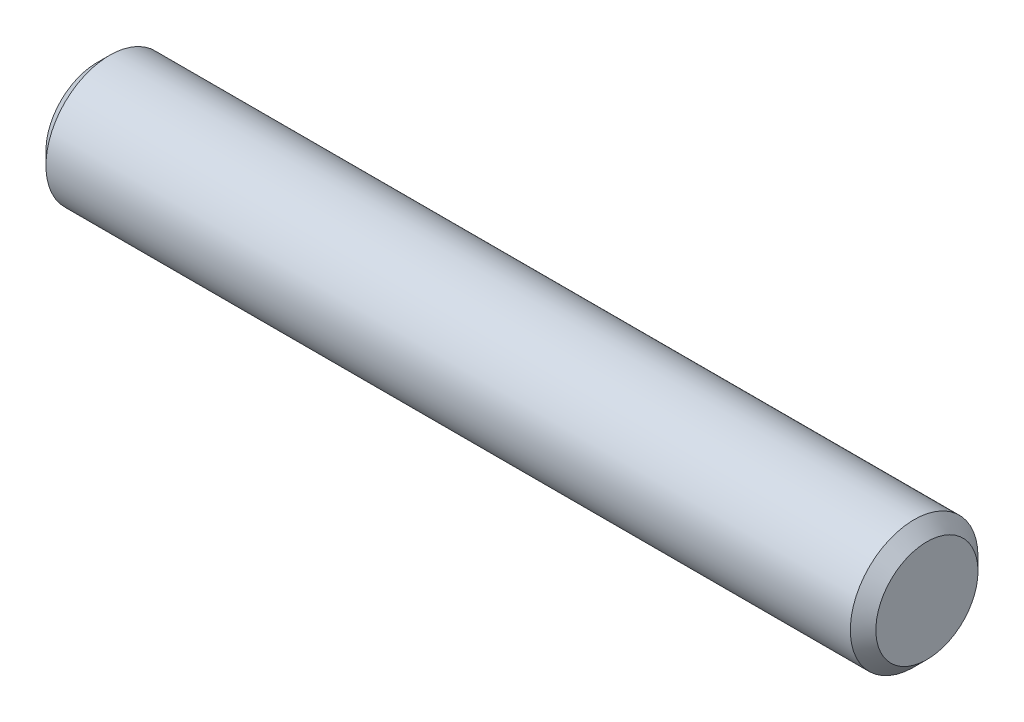
ISO-10303-21;
HEADER;
FILE_DESCRIPTION(('STEP AP214'),'2;1');
FILE_NAME('part.step','',(''),(''),'','','');
FILE_SCHEMA(('AUTOMOTIVE_DESIGN { 1 0 10303 214 1 1 1 1 }'));
ENDSEC;
DATA;
#1=APPLICATION_CONTEXT('core data for automotive mechanical design processes');
#2=APPLICATION_PROTOCOL_DEFINITION('international standard','automotive_design',2000,#1);
#3=PRODUCT_CONTEXT('',#1,'mechanical');
#4=PRODUCT('Part','Part','',(#3));
#5=PRODUCT_RELATED_PRODUCT_CATEGORY('part','',(#4));
#6=PRODUCT_DEFINITION_FORMATION('','',#4);
#7=PRODUCT_DEFINITION_CONTEXT('part definition',#1,'design');
#8=PRODUCT_DEFINITION('design','',#6,#7);
#9=PRODUCT_DEFINITION_SHAPE('','',#8);
#10=(LENGTH_UNIT() NAMED_UNIT(*) SI_UNIT(.MILLI.,.METRE.));
#11=(NAMED_UNIT(*) PLANE_ANGLE_UNIT() SI_UNIT($,.RADIAN.));
#12=(NAMED_UNIT(*) SI_UNIT($,.STERADIAN.) SOLID_ANGLE_UNIT());
#13=UNCERTAINTY_MEASURE_WITH_UNIT(LENGTH_MEASURE(1.E-05),#10,'distance_accuracy_value','');
#14=(GEOMETRIC_REPRESENTATION_CONTEXT(3) GLOBAL_UNCERTAINTY_ASSIGNED_CONTEXT((#13)) GLOBAL_UNIT_ASSIGNED_CONTEXT((#10,
#11,#12)) REPRESENTATION_CONTEXT('',''));
#15=CARTESIAN_POINT('',(0.,0.,0.));
#16=DIRECTION('',(0.,0.,1.));
#17=DIRECTION('',(1.,0.,0.));
#18=AXIS2_PLACEMENT_3D('',#15,#16,#17);
#19=CARTESIAN_POINT('',(-20.6375,0.,0.));
#20=DIRECTION('',(1.,0.,0.));
#21=DIRECTION('',(0.,0.,-1.));
#22=AXIS2_PLACEMENT_3D('',#19,#20,#21);
#23=CYLINDRICAL_SURFACE('',#22,3.175);
#24=CARTESIAN_POINT('',(20.0025,0.,0.));
#25=DIRECTION('',(1.,0.,0.));
#26=DIRECTION('',(0.,0.,-1.));
#27=AXIS2_PLACEMENT_3D('',#24,#25,#26);
#28=CIRCLE('',#27,3.175);
#29=CARTESIAN_POINT('',(20.0025,0.,-3.175));
#30=VERTEX_POINT('',#29);
#31=EDGE_CURVE('E42',#30,#30,#28,.F.);
#32=ORIENTED_EDGE('',*,*,#31,.T.);
#33=EDGE_LOOP('',(#32));
#34=FACE_BOUND('',#33,.T.);
#35=CARTESIAN_POINT('',(-20.0025,0.,0.));
#36=DIRECTION('',(1.,0.,0.));
#37=DIRECTION('',(0.,0.,-1.));
#38=AXIS2_PLACEMENT_3D('',#35,#36,#37);
#39=CIRCLE('',#38,3.175);
#40=CARTESIAN_POINT('',(-20.0025,0.,-3.175));
#41=VERTEX_POINT('',#40);
#42=EDGE_CURVE('E47',#41,#41,#39,.T.);
#43=ORIENTED_EDGE('',*,*,#42,.T.);
#44=EDGE_LOOP('',(#43));
#45=FACE_BOUND('',#44,.T.);
#46=ADVANCED_FACE('F34',(#34,#45),#23,.T.);
#47=CARTESIAN_POINT('',(-20.6375,0.,0.));
#48=DIRECTION('',(1.,0.,0.));
#49=DIRECTION('',(0.,0.,-1.));
#50=AXIS2_PLACEMENT_3D('',#47,#48,#49);
#51=PLANE('',#50);
#52=CARTESIAN_POINT('',(-20.6375,0.,0.));
#53=DIRECTION('',(1.,0.,0.));
#54=DIRECTION('',(0.,0.,-1.));
#55=AXIS2_PLACEMENT_3D('',#52,#53,#54);
#56=CIRCLE('',#55,2.53999999999999);
#57=CARTESIAN_POINT('',(-20.6375,0.,-2.53999999999999));
#58=VERTEX_POINT('',#57);
#59=EDGE_CURVE('E10',#58,#58,#56,.F.);
#60=ORIENTED_EDGE('',*,*,#59,.T.);
#61=EDGE_LOOP('',(#60));
#62=FACE_BOUND('',#61,.T.);
#63=ADVANCED_FACE('F67',(#62),#51,.F.);
#64=CARTESIAN_POINT('',(20.6375,0.,0.));
#65=DIRECTION('',(1.,0.,0.));
#66=DIRECTION('',(0.,0.,-1.));
#67=AXIS2_PLACEMENT_3D('',#64,#65,#66);
#68=PLANE('',#67);
#69=CARTESIAN_POINT('',(20.6375,0.,0.));
#70=DIRECTION('',(1.,0.,0.));
#71=DIRECTION('',(0.,0.,-1.));
#72=AXIS2_PLACEMENT_3D('',#69,#70,#71);
#73=CIRCLE('',#72,2.54);
#74=CARTESIAN_POINT('',(20.6375,0.,-2.54));
#75=VERTEX_POINT('',#74);
#76=EDGE_CURVE('E51',#75,#75,#73,.T.);
#77=ORIENTED_EDGE('',*,*,#76,.T.);
#78=EDGE_LOOP('',(#77));
#79=FACE_BOUND('',#78,.T.);
#80=ADVANCED_FACE('F57',(#79),#68,.T.);
#81=CARTESIAN_POINT('',(20.6375,0.,0.));
#82=DIRECTION('',(-1.,0.,0.));
#83=DIRECTION('',(0.,0.,1.));
#84=AXIS2_PLACEMENT_3D('',#81,#82,#83);
#85=CONICAL_SURFACE('',#84,2.54,0.78539816339745);
#86=ORIENTED_EDGE('',*,*,#31,.F.);
#87=EDGE_LOOP('',(#86));
#88=FACE_BOUND('',#87,.T.);
#89=ORIENTED_EDGE('',*,*,#76,.F.);
#90=EDGE_LOOP('',(#89));
#91=FACE_BOUND('',#90,.T.);
#92=ADVANCED_FACE('F59',(#88,#91),#85,.T.);
#93=CARTESIAN_POINT('',(-20.0025,0.,0.));
#94=DIRECTION('',(1.,0.,0.));
#95=DIRECTION('',(0.,0.,-1.));
#96=AXIS2_PLACEMENT_3D('',#93,#94,#95);
#97=CONICAL_SURFACE('',#96,3.175,0.785398163397456);
#98=ORIENTED_EDGE('',*,*,#59,.F.);
#99=EDGE_LOOP('',(#98));
#100=FACE_BOUND('',#99,.T.);
#101=ORIENTED_EDGE('',*,*,#42,.F.);
#102=EDGE_LOOP('',(#101));
#103=FACE_BOUND('',#102,.T.);
#104=ADVANCED_FACE('F36',(#100,#103),#97,.T.);
#105=CLOSED_SHELL('',(#46,#63,#80,#92,#104));
#106=MANIFOLD_SOLID_BREP('B2',#105);
#107=ADVANCED_BREP_SHAPE_REPRESENTATION('',(#18,#106),#14);
#108=SHAPE_DEFINITION_REPRESENTATION(#9,#107);
ENDSEC;
END-ISO-10303-21;
